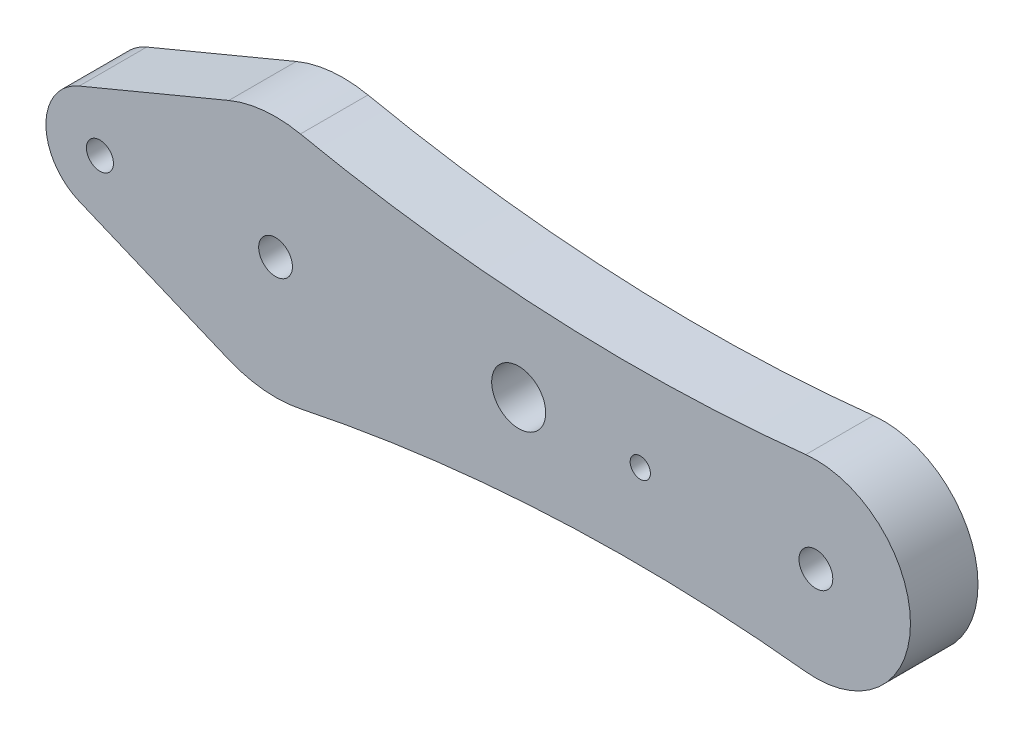
ISO-10303-21;
HEADER;
FILE_DESCRIPTION(('STEP AP214'),'2;1');
FILE_NAME('part.step','',(''),(''),'','','');
FILE_SCHEMA(('AUTOMOTIVE_DESIGN { 1 0 10303 214 1 1 1 1 }'));
ENDSEC;
DATA;
#1=APPLICATION_CONTEXT('core data for automotive mechanical design processes');
#2=APPLICATION_PROTOCOL_DEFINITION('international standard','automotive_design',2000,#1);
#3=PRODUCT_CONTEXT('',#1,'mechanical');
#4=PRODUCT('Part','Part','',(#3));
#5=PRODUCT_RELATED_PRODUCT_CATEGORY('part','',(#4));
#6=PRODUCT_DEFINITION_FORMATION('','',#4);
#7=PRODUCT_DEFINITION_CONTEXT('part definition',#1,'design');
#8=PRODUCT_DEFINITION('design','',#6,#7);
#9=PRODUCT_DEFINITION_SHAPE('','',#8);
#10=(LENGTH_UNIT() NAMED_UNIT(*) SI_UNIT(.MILLI.,.METRE.));
#11=(NAMED_UNIT(*) PLANE_ANGLE_UNIT() SI_UNIT($,.RADIAN.));
#12=(NAMED_UNIT(*) SI_UNIT($,.STERADIAN.) SOLID_ANGLE_UNIT());
#13=UNCERTAINTY_MEASURE_WITH_UNIT(LENGTH_MEASURE(1.E-05),#10,'distance_accuracy_value','');
#14=(GEOMETRIC_REPRESENTATION_CONTEXT(3) GLOBAL_UNCERTAINTY_ASSIGNED_CONTEXT((#13)) GLOBAL_UNIT_ASSIGNED_CONTEXT((#10,
#11,#12)) REPRESENTATION_CONTEXT('',''));
#15=CARTESIAN_POINT('',(0.,0.,0.));
#16=DIRECTION('',(0.,0.,1.));
#17=DIRECTION('',(1.,0.,0.));
#18=AXIS2_PLACEMENT_3D('',#15,#16,#17);
#19=CARTESIAN_POINT('',(-13.,0.,5.));
#20=DIRECTION('',(0.,0.,1.));
#21=DIRECTION('',(1.,0.,0.));
#22=AXIS2_PLACEMENT_3D('',#19,#20,#21);
#23=PLANE('',#22);
#24=CARTESIAN_POINT('',(18.,0.,5.));
#25=DIRECTION('',(0.,0.,1.));
#26=DIRECTION('',(1.,0.,0.));
#27=AXIS2_PLACEMENT_3D('',#24,#25,#26);
#28=CIRCLE('',#27,2.);
#29=CARTESIAN_POINT('',(20.,0.,5.));
#30=VERTEX_POINT('',#29);
#31=EDGE_CURVE('E201',#30,#30,#28,.T.);
#32=ORIENTED_EDGE('',*,*,#31,.F.);
#33=EDGE_LOOP('',(#32));
#34=FACE_BOUND('',#33,.T.);
#35=CARTESIAN_POINT('',(40.,0.,5.));
#36=DIRECTION('',(0.,0.,1.));
#37=DIRECTION('',(1.,0.,0.));
#38=AXIS2_PLACEMENT_3D('',#35,#36,#37);
#39=CIRCLE('',#38,1.25);
#40=CARTESIAN_POINT('',(41.25,0.,5.));
#41=VERTEX_POINT('',#40);
#42=EDGE_CURVE('E189',#41,#41,#39,.T.);
#43=ORIENTED_EDGE('',*,*,#42,.F.);
#44=EDGE_LOOP('',(#43));
#45=FACE_BOUND('',#44,.T.);
#46=CARTESIAN_POINT('',(-13.,0.,5.));
#47=DIRECTION('',(0.,0.,1.));
#48=DIRECTION('',(1.,0.,0.));
#49=AXIS2_PLACEMENT_3D('',#46,#47,#48);
#50=CIRCLE('',#49,4.);
#51=CARTESIAN_POINT('',(-14.5384615384615,3.69230769230769,5.));
#52=VERTEX_POINT('',#51);
#53=CARTESIAN_POINT('',(-14.5384615384615,-3.6923076923077,5.));
#54=VERTEX_POINT('',#53);
#55=EDGE_CURVE('E152',#52,#54,#50,.T.);
#56=ORIENTED_EDGE('',*,*,#55,.T.);
#57=DIRECTION('',(0.923076923076923,-0.384615384615384,0.));
#58=VECTOR('',#57,1.);
#59=CARTESIAN_POINT('',(-14.5384615384615,-3.6923076923077,5.));
#60=LINE('',#59,#58);
#61=CARTESIAN_POINT('',(-3.46153846153846,-8.30769230769231,5.));
#62=VERTEX_POINT('',#61);
#63=EDGE_CURVE('E100',#54,#62,#60,.T.);
#64=ORIENTED_EDGE('',*,*,#63,.T.);
#65=CARTESIAN_POINT('',(0.,0.,5.));
#66=DIRECTION('',(0.,0.,1.));
#67=DIRECTION('',(1.,0.,0.));
#68=AXIS2_PLACEMENT_3D('',#65,#66,#67);
#69=CIRCLE('',#68,9.);
#70=CARTESIAN_POINT('',(1.84186046511628,-8.80951474412987,5.));
#71=VERTEX_POINT('',#70);
#72=EDGE_CURVE('E167',#62,#71,#69,.T.);
#73=ORIENTED_EDGE('',*,*,#72,.T.);
#74=CARTESIAN_POINT('',(26.4,-126.269711332528,5.));
#75=DIRECTION('',(0.,0.,-1.));
#76=DIRECTION('',(-1.,0.,0.));
#77=AXIS2_PLACEMENT_3D('',#74,#75,#76);
#78=CIRCLE('',#77,120.);
#79=CARTESIAN_POINT('',(39.2503937007874,-6.95974786872204,5.));
#80=VERTEX_POINT('',#79);
#81=EDGE_CURVE('E180',#71,#80,#78,.T.);
#82=ORIENTED_EDGE('',*,*,#81,.T.);
#83=CARTESIAN_POINT('',(40.,0.,5.));
#84=DIRECTION('',(0.,0.,1.));
#85=DIRECTION('',(1.,0.,0.));
#86=AXIS2_PLACEMENT_3D('',#83,#84,#85);
#87=CIRCLE('',#86,7.00000000000002);
#88=CARTESIAN_POINT('',(39.2503937007874,6.95974786872204,5.));
#89=VERTEX_POINT('',#88);
#90=EDGE_CURVE('E119',#80,#89,#87,.T.);
#91=ORIENTED_EDGE('',*,*,#90,.T.);
#92=CARTESIAN_POINT('',(26.4,126.269711332528,5.));
#93=DIRECTION('',(0.,0.,-1.));
#94=DIRECTION('',(1.,0.,0.));
#95=AXIS2_PLACEMENT_3D('',#92,#93,#94);
#96=CIRCLE('',#95,120.);
#97=CARTESIAN_POINT('',(1.84186046511625,8.80951474412989,5.));
#98=VERTEX_POINT('',#97);
#99=EDGE_CURVE('E113',#89,#98,#96,.T.);
#100=ORIENTED_EDGE('',*,*,#99,.T.);
#101=CARTESIAN_POINT('',(0.,0.,5.));
#102=DIRECTION('',(0.,0.,1.));
#103=DIRECTION('',(1.,0.,0.));
#104=AXIS2_PLACEMENT_3D('',#101,#102,#103);
#105=CIRCLE('',#104,9.);
#106=CARTESIAN_POINT('',(-3.46153846153846,8.3076923076923,5.));
#107=VERTEX_POINT('',#106);
#108=EDGE_CURVE('E117',#98,#107,#105,.T.);
#109=ORIENTED_EDGE('',*,*,#108,.T.);
#110=DIRECTION('',(-0.923076923076923,-0.384615384615384,0.));
#111=VECTOR('',#110,1.);
#112=CARTESIAN_POINT('',(-14.5384615384615,3.69230769230769,5.));
#113=LINE('',#112,#111);
#114=EDGE_CURVE('E57',#107,#52,#113,.T.);
#115=ORIENTED_EDGE('',*,*,#114,.T.);
#116=EDGE_LOOP('',(#56,#64,#73,#82,#91,#100,#109,#115));
#117=FACE_BOUND('',#116,.T.);
#118=CARTESIAN_POINT('',(0.,0.,5.));
#119=DIRECTION('',(0.,0.,1.));
#120=DIRECTION('',(1.,0.,0.));
#121=AXIS2_PLACEMENT_3D('',#118,#119,#120);
#122=CIRCLE('',#121,1.25);
#123=CARTESIAN_POINT('',(1.25,0.,5.));
#124=VERTEX_POINT('',#123);
#125=EDGE_CURVE('E141',#124,#124,#122,.T.);
#126=ORIENTED_EDGE('',*,*,#125,.F.);
#127=EDGE_LOOP('',(#126));
#128=FACE_BOUND('',#127,.T.);
#129=CARTESIAN_POINT('',(-13.,0.,5.));
#130=DIRECTION('',(0.,0.,1.));
#131=DIRECTION('',(1.,0.,0.));
#132=AXIS2_PLACEMENT_3D('',#129,#130,#131);
#133=CIRCLE('',#132,1.);
#134=CARTESIAN_POINT('',(-12.,0.,5.));
#135=VERTEX_POINT('',#134);
#136=EDGE_CURVE('E195',#135,#135,#133,.T.);
#137=ORIENTED_EDGE('',*,*,#136,.F.);
#138=EDGE_LOOP('',(#137));
#139=FACE_BOUND('',#138,.T.);
#140=CARTESIAN_POINT('',(27.,0.,5.));
#141=DIRECTION('',(0.,0.,1.));
#142=DIRECTION('',(1.,0.,0.));
#143=AXIS2_PLACEMENT_3D('',#140,#141,#142);
#144=CIRCLE('',#143,0.750000000000002);
#145=CARTESIAN_POINT('',(27.75,0.,5.));
#146=VERTEX_POINT('',#145);
#147=EDGE_CURVE('E207',#146,#146,#144,.T.);
#148=ORIENTED_EDGE('',*,*,#147,.F.);
#149=EDGE_LOOP('',(#148));
#150=FACE_BOUND('',#149,.T.);
#151=ADVANCED_FACE('F40',(#34,#45,#117,#128,#139,#150),#23,.T.);
#152=CARTESIAN_POINT('',(-13.,0.,0.));
#153=DIRECTION('',(0.,0.,1.));
#154=DIRECTION('',(1.,0.,0.));
#155=AXIS2_PLACEMENT_3D('',#152,#153,#154);
#156=PLANE('',#155);
#157=CARTESIAN_POINT('',(-13.,0.,0.));
#158=DIRECTION('',(0.,0.,1.));
#159=DIRECTION('',(1.,0.,0.));
#160=AXIS2_PLACEMENT_3D('',#157,#158,#159);
#161=CIRCLE('',#160,4.);
#162=CARTESIAN_POINT('',(-14.5384615384615,3.69230769230769,0.));
#163=VERTEX_POINT('',#162);
#164=CARTESIAN_POINT('',(-14.5384615384615,-3.6923076923077,0.));
#165=VERTEX_POINT('',#164);
#166=EDGE_CURVE('E137',#163,#165,#161,.T.);
#167=ORIENTED_EDGE('',*,*,#166,.F.);
#168=DIRECTION('',(-0.923076923076923,-0.384615384615384,0.));
#169=VECTOR('',#168,1.);
#170=CARTESIAN_POINT('',(-14.5384615384615,3.69230769230769,0.));
#171=LINE('',#170,#169);
#172=CARTESIAN_POINT('',(-3.46153846153846,8.3076923076923,0.));
#173=VERTEX_POINT('',#172);
#174=EDGE_CURVE('E92',#173,#163,#171,.T.);
#175=ORIENTED_EDGE('',*,*,#174,.F.);
#176=CARTESIAN_POINT('',(0.,0.,0.));
#177=DIRECTION('',(0.,0.,1.));
#178=DIRECTION('',(1.,0.,0.));
#179=AXIS2_PLACEMENT_3D('',#176,#177,#178);
#180=CIRCLE('',#179,9.);
#181=CARTESIAN_POINT('',(1.84186046511625,8.80951474412989,0.));
#182=VERTEX_POINT('',#181);
#183=EDGE_CURVE('E86',#182,#173,#180,.T.);
#184=ORIENTED_EDGE('',*,*,#183,.F.);
#185=CARTESIAN_POINT('',(26.4,126.269711332528,0.));
#186=DIRECTION('',(0.,0.,-1.));
#187=DIRECTION('',(1.,0.,0.));
#188=AXIS2_PLACEMENT_3D('',#185,#186,#187);
#189=CIRCLE('',#188,120.);
#190=CARTESIAN_POINT('',(39.2503937007874,6.95974786872204,0.));
#191=VERTEX_POINT('',#190);
#192=EDGE_CURVE('E127',#191,#182,#189,.T.);
#193=ORIENTED_EDGE('',*,*,#192,.F.);
#194=CARTESIAN_POINT('',(40.,0.,0.));
#195=DIRECTION('',(0.,0.,1.));
#196=DIRECTION('',(1.,0.,0.));
#197=AXIS2_PLACEMENT_3D('',#194,#195,#196);
#198=CIRCLE('',#197,7.00000000000002);
#199=CARTESIAN_POINT('',(39.2503937007874,-6.95974786872204,0.));
#200=VERTEX_POINT('',#199);
#201=EDGE_CURVE('E147',#200,#191,#198,.T.);
#202=ORIENTED_EDGE('',*,*,#201,.F.);
#203=CARTESIAN_POINT('',(26.4,-126.269711332528,0.));
#204=DIRECTION('',(0.,0.,-1.));
#205=DIRECTION('',(-1.,0.,0.));
#206=AXIS2_PLACEMENT_3D('',#203,#204,#205);
#207=CIRCLE('',#206,120.);
#208=CARTESIAN_POINT('',(1.84186046511628,-8.80951474412987,0.));
#209=VERTEX_POINT('',#208);
#210=EDGE_CURVE('E145',#209,#200,#207,.T.);
#211=ORIENTED_EDGE('',*,*,#210,.F.);
#212=CARTESIAN_POINT('',(0.,0.,0.));
#213=DIRECTION('',(0.,0.,1.));
#214=DIRECTION('',(1.,0.,0.));
#215=AXIS2_PLACEMENT_3D('',#212,#213,#214);
#216=CIRCLE('',#215,9.);
#217=CARTESIAN_POINT('',(-3.46153846153846,-8.30769230769231,0.));
#218=VERTEX_POINT('',#217);
#219=EDGE_CURVE('E143',#218,#209,#216,.T.);
#220=ORIENTED_EDGE('',*,*,#219,.F.);
#221=DIRECTION('',(0.923076923076923,-0.384615384615384,0.));
#222=VECTOR('',#221,1.);
#223=CARTESIAN_POINT('',(-14.5384615384615,-3.6923076923077,0.));
#224=LINE('',#223,#222);
#225=EDGE_CURVE('E140',#165,#218,#224,.T.);
#226=ORIENTED_EDGE('',*,*,#225,.F.);
#227=EDGE_LOOP('',(#167,#175,#184,#193,#202,#211,#220,#226));
#228=FACE_BOUND('',#227,.T.);
#229=CARTESIAN_POINT('',(0.,0.,0.));
#230=DIRECTION('',(0.,0.,1.));
#231=DIRECTION('',(1.,0.,0.));
#232=AXIS2_PLACEMENT_3D('',#229,#230,#231);
#233=CIRCLE('',#232,1.25);
#234=CARTESIAN_POINT('',(1.25,0.,0.));
#235=VERTEX_POINT('',#234);
#236=EDGE_CURVE('E186',#235,#235,#233,.T.);
#237=ORIENTED_EDGE('',*,*,#236,.T.);
#238=EDGE_LOOP('',(#237));
#239=FACE_BOUND('',#238,.T.);
#240=CARTESIAN_POINT('',(40.,0.,0.));
#241=DIRECTION('',(0.,0.,1.));
#242=DIRECTION('',(1.,0.,0.));
#243=AXIS2_PLACEMENT_3D('',#240,#241,#242);
#244=CIRCLE('',#243,1.25);
#245=CARTESIAN_POINT('',(41.25,0.,0.));
#246=VERTEX_POINT('',#245);
#247=EDGE_CURVE('E192',#246,#246,#244,.T.);
#248=ORIENTED_EDGE('',*,*,#247,.T.);
#249=EDGE_LOOP('',(#248));
#250=FACE_BOUND('',#249,.T.);
#251=CARTESIAN_POINT('',(-13.,0.,0.));
#252=DIRECTION('',(0.,0.,1.));
#253=DIRECTION('',(1.,0.,0.));
#254=AXIS2_PLACEMENT_3D('',#251,#252,#253);
#255=CIRCLE('',#254,1.);
#256=CARTESIAN_POINT('',(-12.,0.,0.));
#257=VERTEX_POINT('',#256);
#258=EDGE_CURVE('E198',#257,#257,#255,.T.);
#259=ORIENTED_EDGE('',*,*,#258,.T.);
#260=EDGE_LOOP('',(#259));
#261=FACE_BOUND('',#260,.T.);
#262=CARTESIAN_POINT('',(18.,0.,0.));
#263=DIRECTION('',(0.,0.,1.));
#264=DIRECTION('',(1.,0.,0.));
#265=AXIS2_PLACEMENT_3D('',#262,#263,#264);
#266=CIRCLE('',#265,2.);
#267=CARTESIAN_POINT('',(20.,0.,0.));
#268=VERTEX_POINT('',#267);
#269=EDGE_CURVE('E204',#268,#268,#266,.T.);
#270=ORIENTED_EDGE('',*,*,#269,.T.);
#271=EDGE_LOOP('',(#270));
#272=FACE_BOUND('',#271,.T.);
#273=CARTESIAN_POINT('',(27.,0.,0.));
#274=DIRECTION('',(0.,0.,1.));
#275=DIRECTION('',(1.,0.,0.));
#276=AXIS2_PLACEMENT_3D('',#273,#274,#275);
#277=CIRCLE('',#276,0.750000000000002);
#278=CARTESIAN_POINT('',(27.75,0.,0.));
#279=VERTEX_POINT('',#278);
#280=EDGE_CURVE('E210',#279,#279,#277,.T.);
#281=ORIENTED_EDGE('',*,*,#280,.T.);
#282=EDGE_LOOP('',(#281));
#283=FACE_BOUND('',#282,.T.);
#284=ADVANCED_FACE('F171',(#228,#239,#250,#261,#272,#283),#156,.F.);
#285=CARTESIAN_POINT('',(-13.,0.,5.));
#286=DIRECTION('',(0.,0.,-1.));
#287=DIRECTION('',(-1.,0.,0.));
#288=AXIS2_PLACEMENT_3D('',#285,#286,#287);
#289=CYLINDRICAL_SURFACE('',#288,4.);
#290=ORIENTED_EDGE('',*,*,#166,.T.);
#291=DIRECTION('',(0.,0.,-1.));
#292=VECTOR('',#291,1.);
#293=CARTESIAN_POINT('',(-14.5384615384615,-3.6923076923077,5.));
#294=LINE('',#293,#292);
#295=EDGE_CURVE('E11',#54,#165,#294,.T.);
#296=ORIENTED_EDGE('',*,*,#295,.F.);
#297=ORIENTED_EDGE('',*,*,#55,.F.);
#298=DIRECTION('',(0.,0.,-1.));
#299=VECTOR('',#298,1.);
#300=CARTESIAN_POINT('',(-14.5384615384615,3.69230769230769,5.));
#301=LINE('',#300,#299);
#302=EDGE_CURVE('E133',#52,#163,#301,.T.);
#303=ORIENTED_EDGE('',*,*,#302,.T.);
#304=EDGE_LOOP('',(#290,#296,#297,#303));
#305=FACE_BOUND('',#304,.T.);
#306=ADVANCED_FACE('F42',(#305),#289,.T.);
#307=CARTESIAN_POINT('',(-14.5384615384615,-3.6923076923077,5.));
#308=DIRECTION('',(0.384615384615384,0.923076923076923,0.));
#309=DIRECTION('',(-0.923076923076923,0.384615384615384,0.));
#310=AXIS2_PLACEMENT_3D('',#307,#308,#309);
#311=PLANE('',#310);
#312=ORIENTED_EDGE('',*,*,#225,.T.);
#313=DIRECTION('',(0.,0.,-1.));
#314=VECTOR('',#313,1.);
#315=CARTESIAN_POINT('',(-3.46153846153846,-8.30769230769231,5.));
#316=LINE('',#315,#314);
#317=EDGE_CURVE('E49',#62,#218,#316,.T.);
#318=ORIENTED_EDGE('',*,*,#317,.F.);
#319=ORIENTED_EDGE('',*,*,#63,.F.);
#320=ORIENTED_EDGE('',*,*,#295,.T.);
#321=EDGE_LOOP('',(#312,#318,#319,#320));
#322=FACE_BOUND('',#321,.T.);
#323=ADVANCED_FACE('F244',(#322),#311,.F.);
#324=CARTESIAN_POINT('',(0.,0.,5.));
#325=DIRECTION('',(0.,0.,-1.));
#326=DIRECTION('',(-1.,0.,0.));
#327=AXIS2_PLACEMENT_3D('',#324,#325,#326);
#328=CYLINDRICAL_SURFACE('',#327,9.);
#329=ORIENTED_EDGE('',*,*,#219,.T.);
#330=DIRECTION('',(0.,0.,-1.));
#331=VECTOR('',#330,1.);
#332=CARTESIAN_POINT('',(1.84186046511628,-8.80951474412987,5.));
#333=LINE('',#332,#331);
#334=EDGE_CURVE('E159',#71,#209,#333,.T.);
#335=ORIENTED_EDGE('',*,*,#334,.F.);
#336=ORIENTED_EDGE('',*,*,#72,.F.);
#337=ORIENTED_EDGE('',*,*,#317,.T.);
#338=EDGE_LOOP('',(#329,#335,#336,#337));
#339=FACE_BOUND('',#338,.T.);
#340=ADVANCED_FACE('F165',(#339),#328,.T.);
#341=CARTESIAN_POINT('',(26.4,-126.269711332528,5.));
#342=DIRECTION('',(0.,0.,-1.));
#343=DIRECTION('',(-1.,0.,0.));
#344=AXIS2_PLACEMENT_3D('',#341,#342,#343);
#345=CYLINDRICAL_SURFACE('',#344,120.);
#346=ORIENTED_EDGE('',*,*,#210,.T.);
#347=DIRECTION('',(0.,0.,-1.));
#348=VECTOR('',#347,1.);
#349=CARTESIAN_POINT('',(39.2503937007874,-6.95974786872204,5.));
#350=LINE('',#349,#348);
#351=EDGE_CURVE('E156',#80,#200,#350,.T.);
#352=ORIENTED_EDGE('',*,*,#351,.F.);
#353=ORIENTED_EDGE('',*,*,#81,.F.);
#354=ORIENTED_EDGE('',*,*,#334,.T.);
#355=EDGE_LOOP('',(#346,#352,#353,#354));
#356=FACE_BOUND('',#355,.T.);
#357=ADVANCED_FACE('F176',(#356),#345,.F.);
#358=CARTESIAN_POINT('',(40.,0.,5.));
#359=DIRECTION('',(0.,0.,-1.));
#360=DIRECTION('',(-1.,0.,0.));
#361=AXIS2_PLACEMENT_3D('',#358,#359,#360);
#362=CYLINDRICAL_SURFACE('',#361,7.00000000000002);
#363=ORIENTED_EDGE('',*,*,#201,.T.);
#364=DIRECTION('',(0.,0.,-1.));
#365=VECTOR('',#364,1.);
#366=CARTESIAN_POINT('',(39.2503937007874,6.95974786872204,5.));
#367=LINE('',#366,#365);
#368=EDGE_CURVE('E128',#89,#191,#367,.T.);
#369=ORIENTED_EDGE('',*,*,#368,.F.);
#370=ORIENTED_EDGE('',*,*,#90,.F.);
#371=ORIENTED_EDGE('',*,*,#351,.T.);
#372=EDGE_LOOP('',(#363,#369,#370,#371));
#373=FACE_BOUND('',#372,.T.);
#374=ADVANCED_FACE('F179',(#373),#362,.T.);
#375=CARTESIAN_POINT('',(26.4,126.269711332528,5.));
#376=DIRECTION('',(0.,0.,-1.));
#377=DIRECTION('',(-1.,0.,0.));
#378=AXIS2_PLACEMENT_3D('',#375,#376,#377);
#379=CYLINDRICAL_SURFACE('',#378,120.);
#380=ORIENTED_EDGE('',*,*,#192,.T.);
#381=DIRECTION('',(0.,0.,-1.));
#382=VECTOR('',#381,1.);
#383=CARTESIAN_POINT('',(1.84186046511625,8.80951474412989,5.));
#384=LINE('',#383,#382);
#385=EDGE_CURVE('E124',#98,#182,#384,.T.);
#386=ORIENTED_EDGE('',*,*,#385,.F.);
#387=ORIENTED_EDGE('',*,*,#99,.F.);
#388=ORIENTED_EDGE('',*,*,#368,.T.);
#389=EDGE_LOOP('',(#380,#386,#387,#388));
#390=FACE_BOUND('',#389,.T.);
#391=ADVANCED_FACE('F125',(#390),#379,.F.);
#392=CARTESIAN_POINT('',(0.,0.,5.));
#393=DIRECTION('',(0.,0.,-1.));
#394=DIRECTION('',(-1.,0.,0.));
#395=AXIS2_PLACEMENT_3D('',#392,#393,#394);
#396=CYLINDRICAL_SURFACE('',#395,9.);
#397=ORIENTED_EDGE('',*,*,#183,.T.);
#398=DIRECTION('',(0.,0.,-1.));
#399=VECTOR('',#398,1.);
#400=CARTESIAN_POINT('',(-3.46153846153846,8.3076923076923,5.));
#401=LINE('',#400,#399);
#402=EDGE_CURVE('E129',#107,#173,#401,.T.);
#403=ORIENTED_EDGE('',*,*,#402,.F.);
#404=ORIENTED_EDGE('',*,*,#108,.F.);
#405=ORIENTED_EDGE('',*,*,#385,.T.);
#406=EDGE_LOOP('',(#397,#403,#404,#405));
#407=FACE_BOUND('',#406,.T.);
#408=ADVANCED_FACE('F131',(#407),#396,.T.);
#409=CARTESIAN_POINT('',(-14.5384615384615,3.69230769230769,5.));
#410=DIRECTION('',(0.384615384615384,-0.923076923076923,0.));
#411=DIRECTION('',(0.923076923076923,0.384615384615384,0.));
#412=AXIS2_PLACEMENT_3D('',#409,#410,#411);
#413=PLANE('',#412);
#414=ORIENTED_EDGE('',*,*,#174,.T.);
#415=ORIENTED_EDGE('',*,*,#302,.F.);
#416=ORIENTED_EDGE('',*,*,#114,.F.);
#417=ORIENTED_EDGE('',*,*,#402,.T.);
#418=EDGE_LOOP('',(#414,#415,#416,#417));
#419=FACE_BOUND('',#418,.T.);
#420=ADVANCED_FACE('F232',(#419),#413,.F.);
#421=CARTESIAN_POINT('',(0.,0.,5.));
#422=DIRECTION('',(0.,0.,-1.));
#423=DIRECTION('',(-1.,0.,0.));
#424=AXIS2_PLACEMENT_3D('',#421,#422,#423);
#425=CYLINDRICAL_SURFACE('',#424,1.25);
#426=ORIENTED_EDGE('',*,*,#125,.T.);
#427=EDGE_LOOP('',(#426));
#428=FACE_BOUND('',#427,.T.);
#429=ORIENTED_EDGE('',*,*,#236,.F.);
#430=EDGE_LOOP('',(#429));
#431=FACE_BOUND('',#430,.T.);
#432=ADVANCED_FACE('F229',(#428,#431),#425,.F.);
#433=CARTESIAN_POINT('',(40.,0.,5.));
#434=DIRECTION('',(0.,0.,-1.));
#435=DIRECTION('',(-1.,0.,0.));
#436=AXIS2_PLACEMENT_3D('',#433,#434,#435);
#437=CYLINDRICAL_SURFACE('',#436,1.25);
#438=ORIENTED_EDGE('',*,*,#42,.T.);
#439=EDGE_LOOP('',(#438));
#440=FACE_BOUND('',#439,.T.);
#441=ORIENTED_EDGE('',*,*,#247,.F.);
#442=EDGE_LOOP('',(#441));
#443=FACE_BOUND('',#442,.T.);
#444=ADVANCED_FACE('F274',(#440,#443),#437,.F.);
#445=CARTESIAN_POINT('',(-13.,0.,5.));
#446=DIRECTION('',(0.,0.,-1.));
#447=DIRECTION('',(-1.,0.,0.));
#448=AXIS2_PLACEMENT_3D('',#445,#446,#447);
#449=CYLINDRICAL_SURFACE('',#448,1.);
#450=ORIENTED_EDGE('',*,*,#136,.T.);
#451=EDGE_LOOP('',(#450));
#452=FACE_BOUND('',#451,.T.);
#453=ORIENTED_EDGE('',*,*,#258,.F.);
#454=EDGE_LOOP('',(#453));
#455=FACE_BOUND('',#454,.T.);
#456=ADVANCED_FACE('F291',(#452,#455),#449,.F.);
#457=CARTESIAN_POINT('',(18.,0.,5.));
#458=DIRECTION('',(0.,0.,-1.));
#459=DIRECTION('',(-1.,0.,0.));
#460=AXIS2_PLACEMENT_3D('',#457,#458,#459);
#461=CYLINDRICAL_SURFACE('',#460,2.);
#462=ORIENTED_EDGE('',*,*,#31,.T.);
#463=EDGE_LOOP('',(#462));
#464=FACE_BOUND('',#463,.T.);
#465=ORIENTED_EDGE('',*,*,#269,.F.);
#466=EDGE_LOOP('',(#465));
#467=FACE_BOUND('',#466,.T.);
#468=ADVANCED_FACE('F302',(#464,#467),#461,.F.);
#469=CARTESIAN_POINT('',(27.,0.,5.));
#470=DIRECTION('',(0.,0.,-1.));
#471=DIRECTION('',(-1.,0.,0.));
#472=AXIS2_PLACEMENT_3D('',#469,#470,#471);
#473=CYLINDRICAL_SURFACE('',#472,0.750000000000002);
#474=ORIENTED_EDGE('',*,*,#147,.T.);
#475=EDGE_LOOP('',(#474));
#476=FACE_BOUND('',#475,.T.);
#477=ORIENTED_EDGE('',*,*,#280,.F.);
#478=EDGE_LOOP('',(#477));
#479=FACE_BOUND('',#478,.T.);
#480=ADVANCED_FACE('F216',(#476,#479),#473,.F.);
#481=CLOSED_SHELL('',(#151,#284,#306,#323,#340,#357,#374,#391,#408,#420,#432,#444,#456,#468,#480));
#482=MANIFOLD_SOLID_BREP('B2',#481);
#483=ADVANCED_BREP_SHAPE_REPRESENTATION('',(#18,#482),#14);
#484=SHAPE_DEFINITION_REPRESENTATION(#9,#483);
ENDSEC;
END-ISO-10303-21;
